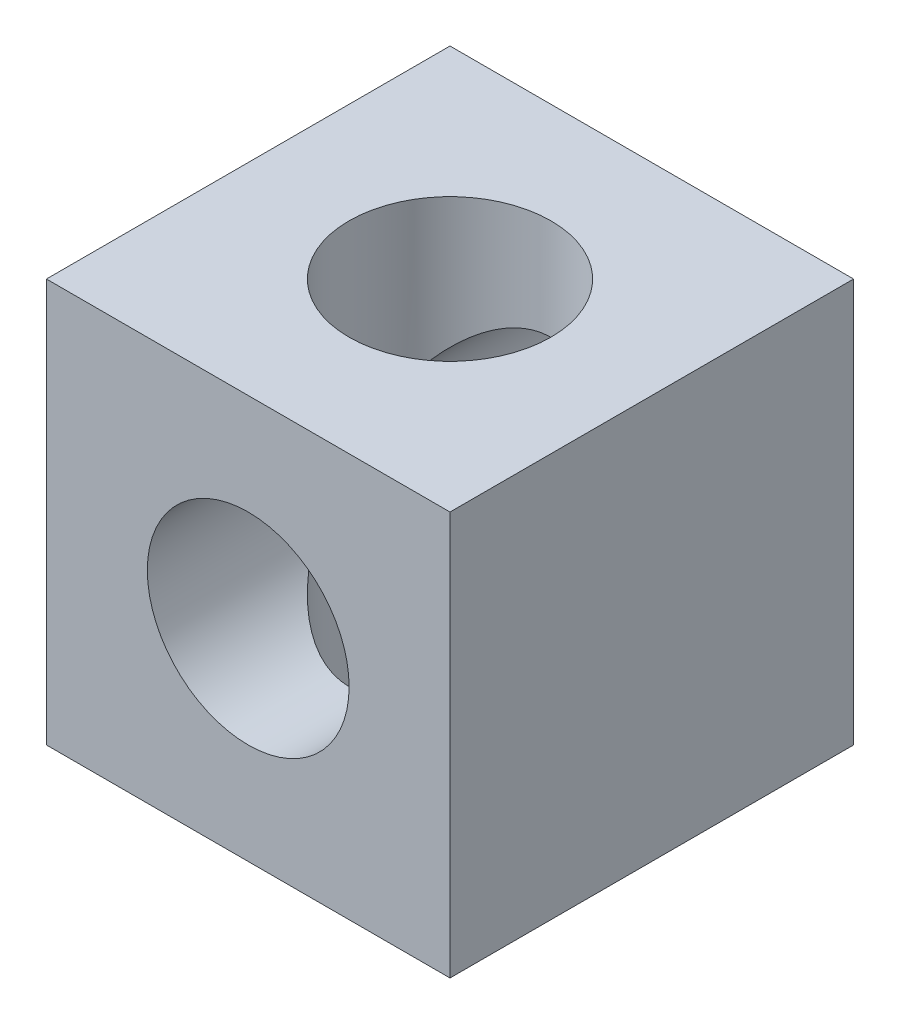
ISO-10303-21;
HEADER;
FILE_DESCRIPTION(('STEP AP214'),'2;1');
FILE_NAME('part.step','',(''),(''),'','','');
FILE_SCHEMA(('AUTOMOTIVE_DESIGN { 1 0 10303 214 1 1 1 1 }'));
ENDSEC;
DATA;
#1=APPLICATION_CONTEXT('core data for automotive mechanical design processes');
#2=APPLICATION_PROTOCOL_DEFINITION('international standard','automotive_design',2000,#1);
#3=PRODUCT_CONTEXT('',#1,'mechanical');
#4=PRODUCT('Part','Part','',(#3));
#5=PRODUCT_RELATED_PRODUCT_CATEGORY('part','',(#4));
#6=PRODUCT_DEFINITION_FORMATION('','',#4);
#7=PRODUCT_DEFINITION_CONTEXT('part definition',#1,'design');
#8=PRODUCT_DEFINITION('design','',#6,#7);
#9=PRODUCT_DEFINITION_SHAPE('','',#8);
#10=(LENGTH_UNIT() NAMED_UNIT(*) SI_UNIT(.MILLI.,.METRE.));
#11=(NAMED_UNIT(*) PLANE_ANGLE_UNIT() SI_UNIT($,.RADIAN.));
#12=(NAMED_UNIT(*) SI_UNIT($,.STERADIAN.) SOLID_ANGLE_UNIT());
#13=UNCERTAINTY_MEASURE_WITH_UNIT(LENGTH_MEASURE(1.E-05),#10,'distance_accuracy_value','');
#14=(GEOMETRIC_REPRESENTATION_CONTEXT(3) GLOBAL_UNCERTAINTY_ASSIGNED_CONTEXT((#13)) GLOBAL_UNIT_ASSIGNED_CONTEXT((#10,
#11,#12)) REPRESENTATION_CONTEXT('',''));
#15=CARTESIAN_POINT('',(0.,0.,0.));
#16=DIRECTION('',(0.,0.,1.));
#17=DIRECTION('',(1.,0.,0.));
#18=AXIS2_PLACEMENT_3D('',#15,#16,#17);
#19=CARTESIAN_POINT('',(-2.22044604925031E-13,0.,10.));
#20=DIRECTION('',(0.,0.,-1.00000000000002));
#21=DIRECTION('',(-1.,0.,0.));
#22=AXIS2_PLACEMENT_3D('',#19,#20,#21);
#23=CYLINDRICAL_SURFACE('',#22,2.5);
#24=CARTESIAN_POINT('',(-2.22044604925031E-13,2.15105711021124E-12,4.99999999999967));
#25=DIRECTION('',(0.,0.707106781186556,-0.707106781186566));
#26=DIRECTION('',(0.,-0.707106781186556,-0.707106781186568));
#27=AXIS2_PLACEMENT_3D('',#24,#25,#26);
#28=ELLIPSE('',#27,3.53553390593274,2.5);
#29=CARTESIAN_POINT('',(2.50000000000017,2.19269047363468E-12,4.99999999999956));
#30=VERTEX_POINT('',#29);
#31=CARTESIAN_POINT('',(-2.49999999999995,1.47104550762833E-12,5.00000000000012));
#32=VERTEX_POINT('',#31);
#33=EDGE_CURVE('E11',#30,#32,#28,.F.);
#34=ORIENTED_EDGE('',*,*,#33,.F.);
#35=CARTESIAN_POINT('',(-2.22044604925031E-13,2.15105711021124E-12,4.99999999999967));
#36=DIRECTION('',(0.,-0.707106781186556,-0.707106781186568));
#37=DIRECTION('',(0.,0.707106781186556,-0.707106781186566));
#38=AXIS2_PLACEMENT_3D('',#35,#36,#37);
#39=ELLIPSE('',#38,3.53553390593274,2.5);
#40=EDGE_CURVE('E30',#32,#30,#39,.F.);
#41=ORIENTED_EDGE('',*,*,#40,.F.);
#42=EDGE_LOOP('',(#34,#41));
#43=FACE_BOUND('',#42,.T.);
#44=CARTESIAN_POINT('',(-2.22044604925031E-13,0.,10.));
#45=DIRECTION('',(0.,0.,1.00000000000002));
#46=DIRECTION('',(1.,0.,0.));
#47=AXIS2_PLACEMENT_3D('',#44,#45,#46);
#48=CIRCLE('',#47,2.5);
#49=CARTESIAN_POINT('',(2.49999999999978,0.,10.));
#50=VERTEX_POINT('',#49);
#51=EDGE_CURVE('E106',#50,#50,#48,.T.);
#52=ORIENTED_EDGE('',*,*,#51,.T.);
#53=EDGE_LOOP('',(#52));
#54=FACE_BOUND('',#53,.T.);
#55=ADVANCED_FACE('F16',(#43,#54),#23,.F.);
#56=CARTESIAN_POINT('',(-5.00000000000067,-4.99999999999913,9.9999999999999));
#57=DIRECTION('',(0.,0.,-1.00000000000002));
#58=DIRECTION('',(-1.,0.,0.));
#59=AXIS2_PLACEMENT_3D('',#56,#57,#58);
#60=PLANE('',#59);
#61=DIRECTION('',(0.,-1.,0.));
#62=VECTOR('',#61,1.);
#63=CARTESIAN_POINT('',(-5.00000000000067,-4.99999999999913,9.9999999999999));
#64=LINE('',#63,#62);
#65=CARTESIAN_POINT('',(-5.00000000000084,5.00000000000039,10.0000000000001));
#66=VERTEX_POINT('',#65);
#67=CARTESIAN_POINT('',(-5.00000000000067,-4.99999999999913,9.9999999999999));
#68=VERTEX_POINT('',#67);
#69=EDGE_CURVE('E95',#66,#68,#64,.T.);
#70=ORIENTED_EDGE('',*,*,#69,.T.);
#71=DIRECTION('',(1.,0.,0.));
#72=VECTOR('',#71,1.);
#73=CARTESIAN_POINT('',(-5.00000000000067,-4.99999999999913,9.9999999999999));
#74=LINE('',#73,#72);
#75=CARTESIAN_POINT('',(5.00000000000006,-4.99999999999844,9.99999999998902));
#76=VERTEX_POINT('',#75);
#77=EDGE_CURVE('E93',#68,#76,#74,.T.);
#78=ORIENTED_EDGE('',*,*,#77,.T.);
#79=DIRECTION('',(0.,1.,0.));
#80=VECTOR('',#79,1.);
#81=CARTESIAN_POINT('',(5.00000000000006,-4.99999999999844,9.99999999998902));
#82=LINE('',#81,#80);
#83=CARTESIAN_POINT('',(4.99999999999928,5.00000000000157,10.0000000000003));
#84=VERTEX_POINT('',#83);
#85=EDGE_CURVE('E91',#76,#84,#82,.T.);
#86=ORIENTED_EDGE('',*,*,#85,.T.);
#87=DIRECTION('',(-1.,0.,0.));
#88=VECTOR('',#87,1.);
#89=CARTESIAN_POINT('',(-5.00000000000084,5.00000000000039,10.0000000000001));
#90=LINE('',#89,#88);
#91=EDGE_CURVE('E38',#84,#66,#90,.T.);
#92=ORIENTED_EDGE('',*,*,#91,.T.);
#93=EDGE_LOOP('',(#70,#78,#86,#92));
#94=FACE_BOUND('',#93,.T.);
#95=ORIENTED_EDGE('',*,*,#51,.F.);
#96=EDGE_LOOP('',(#95));
#97=FACE_BOUND('',#96,.T.);
#98=ADVANCED_FACE('F138',(#94,#97),#60,.F.);
#99=CARTESIAN_POINT('',(-5.00000000000156,-4.99999999999874,-1.53210777398272E-11));
#100=DIRECTION('',(0.,0.,-1.00000000000002));
#101=DIRECTION('',(-1.,0.,0.));
#102=AXIS2_PLACEMENT_3D('',#99,#100,#101);
#103=PLANE('',#102);
#104=DIRECTION('',(0.,-1.,0.));
#105=VECTOR('',#104,1.);
#106=CARTESIAN_POINT('',(-5.00000000000156,-4.99999999999874,-1.53210777398272E-11));
#107=LINE('',#106,#105);
#108=CARTESIAN_POINT('',(-5.00000000000045,5.00000000000228,2.1094237467878E-12));
#109=VERTEX_POINT('',#108);
#110=CARTESIAN_POINT('',(-5.00000000000156,-4.99999999999874,-1.53210777398272E-11));
#111=VERTEX_POINT('',#110);
#112=EDGE_CURVE('E103',#109,#111,#107,.T.);
#113=ORIENTED_EDGE('',*,*,#112,.F.);
#114=DIRECTION('',(-1.,0.,0.));
#115=VECTOR('',#114,1.);
#116=CARTESIAN_POINT('',(-5.00000000000045,5.00000000000228,2.1094237467878E-12));
#117=LINE('',#116,#115);
#118=CARTESIAN_POINT('',(4.99999999999878,5.00000000000093,-9.32587340685131E-12));
#119=VERTEX_POINT('',#118);
#120=EDGE_CURVE('E97',#119,#109,#117,.T.);
#121=ORIENTED_EDGE('',*,*,#120,.F.);
#122=DIRECTION('',(0.,1.,0.));
#123=VECTOR('',#122,1.);
#124=CARTESIAN_POINT('',(5.,-5.,-1.11022302462516E-13));
#125=LINE('',#124,#123);
#126=CARTESIAN_POINT('',(5.,-5.,-1.11022302462516E-13));
#127=VERTEX_POINT('',#126);
#128=EDGE_CURVE('E99',#127,#119,#125,.T.);
#129=ORIENTED_EDGE('',*,*,#128,.F.);
#130=DIRECTION('',(1.,0.,0.));
#131=VECTOR('',#130,1.);
#132=CARTESIAN_POINT('',(-5.00000000000156,-4.99999999999874,-1.53210777398272E-11));
#133=LINE('',#132,#131);
#134=EDGE_CURVE('E101',#111,#127,#133,.T.);
#135=ORIENTED_EDGE('',*,*,#134,.F.);
#136=EDGE_LOOP('',(#113,#121,#129,#135));
#137=FACE_BOUND('',#136,.T.);
#138=CARTESIAN_POINT('',(-1.11022302462516E-13,1.66533453693773E-12,-1.11022302462516E-13));
#139=DIRECTION('',(0.,0.,1.00000000000002));
#140=DIRECTION('',(1.,0.,0.));
#141=AXIS2_PLACEMENT_3D('',#138,#139,#140);
#142=CIRCLE('',#141,2.5);
#143=CARTESIAN_POINT('',(2.49999999999989,1.66730778489166E-12,-1.09634523681734E-13));
#144=VERTEX_POINT('',#143);
#145=EDGE_CURVE('E109',#144,#144,#142,.T.);
#146=ORIENTED_EDGE('',*,*,#145,.T.);
#147=EDGE_LOOP('',(#146));
#148=FACE_BOUND('',#147,.T.);
#149=ADVANCED_FACE('F132',(#137,#148),#103,.T.);
#150=CARTESIAN_POINT('',(-5.00000000000067,-4.99999999999913,9.9999999999999));
#151=DIRECTION('',(1.,0.,0.));
#152=DIRECTION('',(0.,0.,-1.00000000000002));
#153=AXIS2_PLACEMENT_3D('',#150,#151,#152);
#154=PLANE('',#153);
#155=ORIENTED_EDGE('',*,*,#112,.T.);
#156=DIRECTION('',(0.,0.,-1.00000000000002));
#157=VECTOR('',#156,1.);
#158=CARTESIAN_POINT('',(-5.00000000000067,-4.99999999999913,9.9999999999999));
#159=LINE('',#158,#157);
#160=EDGE_CURVE('E73',#68,#111,#159,.T.);
#161=ORIENTED_EDGE('',*,*,#160,.F.);
#162=ORIENTED_EDGE('',*,*,#69,.F.);
#163=DIRECTION('',(0.,0.,-1.00000000000002));
#164=VECTOR('',#163,1.);
#165=CARTESIAN_POINT('',(-5.00000000000084,5.00000000000039,10.0000000000001));
#166=LINE('',#165,#164);
#167=EDGE_CURVE('E87',#66,#109,#166,.T.);
#168=ORIENTED_EDGE('',*,*,#167,.T.);
#169=EDGE_LOOP('',(#155,#161,#162,#168));
#170=FACE_BOUND('',#169,.T.);
#171=ADVANCED_FACE('F18',(#170),#154,.F.);
#172=CARTESIAN_POINT('',(-5.00000000000067,-4.99999999999913,9.9999999999999));
#173=DIRECTION('',(0.,1.,0.));
#174=DIRECTION('',(0.,0.,1.00000000000002));
#175=AXIS2_PLACEMENT_3D('',#172,#173,#174);
#176=PLANE('',#175);
#177=CARTESIAN_POINT('',(6.10622663543836E-13,-4.99999999999976,5.00000000000012));
#178=DIRECTION('',(0.,1.,0.));
#179=DIRECTION('',(0.,0.,1.00000000000002));
#180=AXIS2_PLACEMENT_3D('',#177,#178,#179);
#181=CIRCLE('',#180,2.5);
#182=CARTESIAN_POINT('',(6.09512440519211E-13,-4.99999999999976,7.50000000000016));
#183=VERTEX_POINT('',#182);
#184=EDGE_CURVE('E112',#183,#183,#181,.T.);
#185=ORIENTED_EDGE('',*,*,#184,.T.);
#186=EDGE_LOOP('',(#185));
#187=FACE_BOUND('',#186,.T.);
#188=ORIENTED_EDGE('',*,*,#134,.T.);
#189=DIRECTION('',(0.,0.,-1.00000000000002));
#190=VECTOR('',#189,1.);
#191=CARTESIAN_POINT('',(5.00000000000006,-4.99999999999844,9.99999999998902));
#192=LINE('',#191,#190);
#193=EDGE_CURVE('E81',#76,#127,#192,.T.);
#194=ORIENTED_EDGE('',*,*,#193,.F.);
#195=ORIENTED_EDGE('',*,*,#77,.F.);
#196=ORIENTED_EDGE('',*,*,#160,.T.);
#197=EDGE_LOOP('',(#188,#194,#195,#196));
#198=FACE_BOUND('',#197,.T.);
#199=ADVANCED_FACE('F136',(#187,#198),#176,.F.);
#200=CARTESIAN_POINT('',(5.00000000000006,-4.99999999999844,9.99999999998902));
#201=DIRECTION('',(-1.,0.,0.));
#202=DIRECTION('',(0.,0.,1.00000000000002));
#203=AXIS2_PLACEMENT_3D('',#200,#201,#202);
#204=PLANE('',#203);
#205=ORIENTED_EDGE('',*,*,#128,.T.);
#206=DIRECTION('',(0.,0.,-1.00000000000002));
#207=VECTOR('',#206,1.);
#208=CARTESIAN_POINT('',(4.99999999999928,5.00000000000157,10.0000000000003));
#209=LINE('',#208,#207);
#210=EDGE_CURVE('E84',#84,#119,#209,.T.);
#211=ORIENTED_EDGE('',*,*,#210,.F.);
#212=ORIENTED_EDGE('',*,*,#85,.F.);
#213=ORIENTED_EDGE('',*,*,#193,.T.);
#214=EDGE_LOOP('',(#205,#211,#212,#213));
#215=FACE_BOUND('',#214,.T.);
#216=ADVANCED_FACE('F122',(#215),#204,.F.);
#217=CARTESIAN_POINT('',(-5.00000000000084,5.00000000000039,10.0000000000001));
#218=DIRECTION('',(0.,-1.,0.));
#219=DIRECTION('',(1.,0.,0.));
#220=AXIS2_PLACEMENT_3D('',#217,#218,#219);
#221=PLANE('',#220);
#222=CARTESIAN_POINT('',(-9.43689570931383E-13,5.0000000000016,4.99999999999334));
#223=DIRECTION('',(0.,1.,0.));
#224=DIRECTION('',(0.,0.,1.00000000000002));
#225=AXIS2_PLACEMENT_3D('',#222,#223,#224);
#226=CIRCLE('',#225,2.5);
#227=CARTESIAN_POINT('',(-9.44799793956008E-13,5.0000000000016,7.49999999999338));
#228=VERTEX_POINT('',#227);
#229=EDGE_CURVE('E115',#228,#228,#226,.T.);
#230=ORIENTED_EDGE('',*,*,#229,.F.);
#231=EDGE_LOOP('',(#230));
#232=FACE_BOUND('',#231,.T.);
#233=ORIENTED_EDGE('',*,*,#120,.T.);
#234=ORIENTED_EDGE('',*,*,#167,.F.);
#235=ORIENTED_EDGE('',*,*,#91,.F.);
#236=ORIENTED_EDGE('',*,*,#210,.T.);
#237=EDGE_LOOP('',(#233,#234,#235,#236));
#238=FACE_BOUND('',#237,.T.);
#239=ADVANCED_FACE('F119',(#232,#238),#221,.F.);
#240=CARTESIAN_POINT('',(-2.22044604925031E-13,2.15105711021124E-12,4.99999999999967));
#241=DIRECTION('',(0.,0.707106781186556,-0.707106781186566));
#242=DIRECTION('',(0.,-0.707106781186556,-0.707106781186568));
#243=AXIS2_PLACEMENT_3D('',#240,#241,#242);
#244=ELLIPSE('',#243,3.53553390593274,2.5);
#245=EDGE_CURVE('E24',#30,#32,#244,.T.);
#246=ORIENTED_EDGE('',*,*,#245,.F.);
#247=CARTESIAN_POINT('',(-2.22044604925031E-13,2.15105711021124E-12,4.99999999999967));
#248=DIRECTION('',(0.,-0.707106781186556,-0.707106781186568));
#249=DIRECTION('',(0.,0.707106781186556,-0.707106781186566));
#250=AXIS2_PLACEMENT_3D('',#247,#248,#249);
#251=ELLIPSE('',#250,3.53553390593274,2.5);
#252=EDGE_CURVE('E64',#32,#30,#251,.T.);
#253=ORIENTED_EDGE('',*,*,#252,.F.);
#254=EDGE_LOOP('',(#246,#253));
#255=FACE_BOUND('',#254,.T.);
#256=ORIENTED_EDGE('',*,*,#145,.F.);
#257=EDGE_LOOP('',(#256));
#258=FACE_BOUND('',#257,.T.);
#259=ADVANCED_FACE('F76',(#255,#258),#23,.F.);
#260=CARTESIAN_POINT('',(6.10622663543836E-13,-4.99999999999976,5.00000000000012));
#261=DIRECTION('',(0.,1.,0.));
#262=DIRECTION('',(0.,0.,1.00000000000002));
#263=AXIS2_PLACEMENT_3D('',#260,#261,#262);
#264=CYLINDRICAL_SURFACE('',#263,2.5);
#265=ORIENTED_EDGE('',*,*,#245,.T.);
#266=ORIENTED_EDGE('',*,*,#40,.T.);
#267=EDGE_LOOP('',(#265,#266));
#268=FACE_BOUND('',#267,.T.);
#269=ORIENTED_EDGE('',*,*,#184,.F.);
#270=EDGE_LOOP('',(#269));
#271=FACE_BOUND('',#270,.T.);
#272=ADVANCED_FACE('F71',(#268,#271),#264,.F.);
#273=ORIENTED_EDGE('',*,*,#33,.T.);
#274=ORIENTED_EDGE('',*,*,#252,.T.);
#275=EDGE_LOOP('',(#273,#274));
#276=FACE_BOUND('',#275,.T.);
#277=ORIENTED_EDGE('',*,*,#229,.T.);
#278=EDGE_LOOP('',(#277));
#279=FACE_BOUND('',#278,.T.);
#280=ADVANCED_FACE('F65',(#276,#279),#264,.F.);
#281=CLOSED_SHELL('',(#55,#98,#149,#171,#199,#216,#239,#259,#272,#280));
#282=MANIFOLD_SOLID_BREP('B1',#281);
#283=ADVANCED_BREP_SHAPE_REPRESENTATION('',(#18,#282),#14);
#284=SHAPE_DEFINITION_REPRESENTATION(#9,#283);
ENDSEC;
END-ISO-10303-21;
